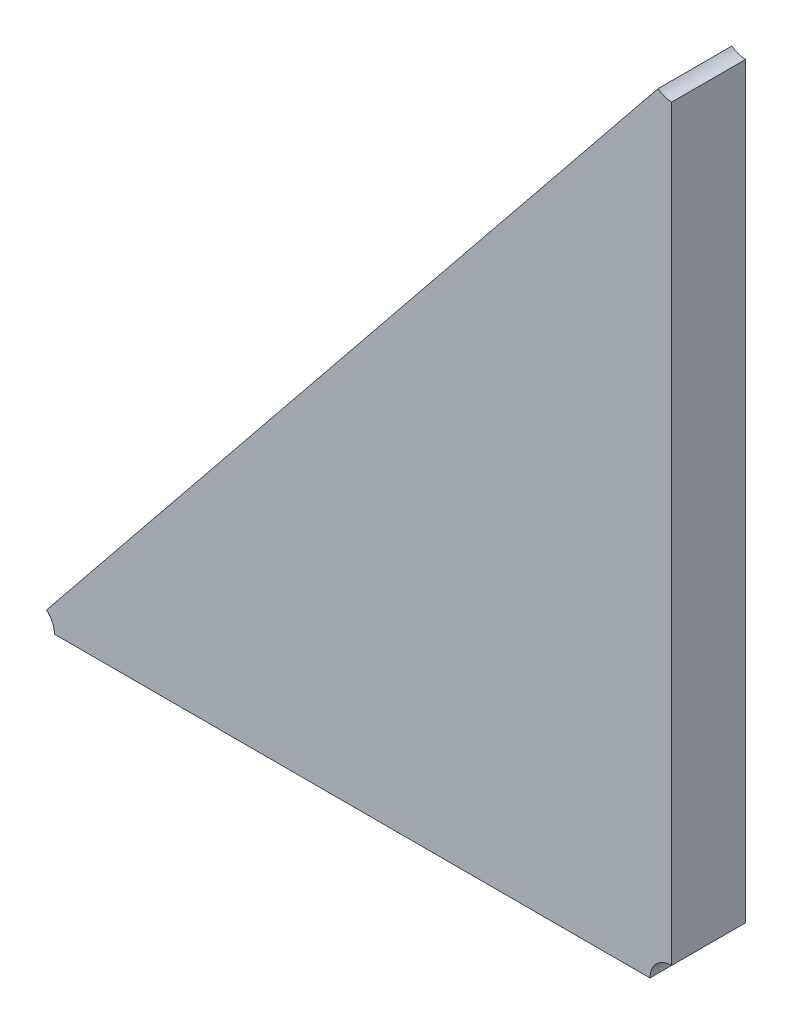
ISO-10303-21;
HEADER;
FILE_DESCRIPTION(('STEP AP214'),'2;1');
FILE_NAME('part.step','',(''),(''),'','','');
FILE_SCHEMA(('AUTOMOTIVE_DESIGN { 1 0 10303 214 1 1 1 1 }'));
ENDSEC;
DATA;
#1=APPLICATION_CONTEXT('core data for automotive mechanical design processes');
#2=APPLICATION_PROTOCOL_DEFINITION('international standard','automotive_design',2000,#1);
#3=PRODUCT_CONTEXT('',#1,'mechanical');
#4=PRODUCT('Part','Part','',(#3));
#5=PRODUCT_RELATED_PRODUCT_CATEGORY('part','',(#4));
#6=PRODUCT_DEFINITION_FORMATION('','',#4);
#7=PRODUCT_DEFINITION_CONTEXT('part definition',#1,'design');
#8=PRODUCT_DEFINITION('design','',#6,#7);
#9=PRODUCT_DEFINITION_SHAPE('','',#8);
#10=(LENGTH_UNIT() NAMED_UNIT(*) SI_UNIT(.MILLI.,.METRE.));
#11=(NAMED_UNIT(*) PLANE_ANGLE_UNIT() SI_UNIT($,.RADIAN.));
#12=(NAMED_UNIT(*) SI_UNIT($,.STERADIAN.) SOLID_ANGLE_UNIT());
#13=UNCERTAINTY_MEASURE_WITH_UNIT(LENGTH_MEASURE(1.E-05),#10,'distance_accuracy_value','');
#14=(GEOMETRIC_REPRESENTATION_CONTEXT(3) GLOBAL_UNCERTAINTY_ASSIGNED_CONTEXT((#13)) GLOBAL_UNIT_ASSIGNED_CONTEXT((#10,
#11,#12)) REPRESENTATION_CONTEXT('',''));
#15=CARTESIAN_POINT('',(0.,0.,0.));
#16=DIRECTION('',(0.,0.,1.));
#17=DIRECTION('',(1.,0.,0.));
#18=AXIS2_PLACEMENT_3D('',#15,#16,#17);
#19=CARTESIAN_POINT('',(-1.38545293845535,-1.33390159204412,0.0042));
#20=DIRECTION('',(0.,0.,1.));
#21=DIRECTION('',(1.,0.,0.));
#22=AXIS2_PLACEMENT_3D('',#19,#20,#21);
#23=PLANE('',#22);
#24=CARTESIAN_POINT('',(-1.40493158368277,-1.34730973343148,0.0042));
#25=DIRECTION('',(0.,0.,-1.));
#26=DIRECTION('',(0.628289208449116,0.777979865129158,0.));
#27=AXIS2_PLACEMENT_3D('',#24,#25,#26);
#28=CIRCLE('',#27,0.000999999999999988);
#29=CARTESIAN_POINT('',(-1.40430329447432,-1.34653175356635,0.0042));
#30=VERTEX_POINT('',#29);
#31=CARTESIAN_POINT('',(-1.40393158368277,-1.34730973343148,0.0042));
#32=VERTEX_POINT('',#31);
#33=EDGE_CURVE('E11',#30,#32,#28,.T.);
#34=ORIENTED_EDGE('',*,*,#33,.T.);
#35=DIRECTION('',(1.,0.,0.));
#36=VECTOR('',#35,1.);
#37=CARTESIAN_POINT('',(-1.40393158368277,-1.34730973343148,0.0042));
#38=LINE('',#37,#36);
#39=CARTESIAN_POINT('',(-1.37652796514819,-1.34730973343148,0.0042));
#40=VERTEX_POINT('',#39);
#41=EDGE_CURVE('E102',#32,#40,#38,.T.);
#42=ORIENTED_EDGE('',*,*,#41,.T.);
#43=CARTESIAN_POINT('',(-1.37552796514819,-1.34730973343148,0.0042));
#44=DIRECTION('',(0.,0.,-1.));
#45=DIRECTION('',(-1.,0.,0.));
#46=AXIS2_PLACEMENT_3D('',#43,#44,#45);
#47=CIRCLE('',#46,0.000999999999999999);
#48=CARTESIAN_POINT('',(-1.37552796514819,-1.34630973343148,0.0042));
#49=VERTEX_POINT('',#48);
#50=EDGE_CURVE('E89',#40,#49,#47,.T.);
#51=ORIENTED_EDGE('',*,*,#50,.T.);
#52=DIRECTION('',(0.,1.,0.));
#53=VECTOR('',#52,1.);
#54=CARTESIAN_POINT('',(-1.37552796514819,-1.34630973343148,0.0042));
#55=LINE('',#54,#53);
#56=CARTESIAN_POINT('',(-1.37552796514819,-1.31190066755203,0.0042));
#57=VERTEX_POINT('',#56);
#58=EDGE_CURVE('E94',#49,#57,#55,.T.);
#59=ORIENTED_EDGE('',*,*,#58,.T.);
#60=CARTESIAN_POINT('',(-1.37552796514819,-1.31090066755203,0.0042));
#61=DIRECTION('',(0.,0.,-1.));
#62=DIRECTION('',(0.,-1.,0.));
#63=AXIS2_PLACEMENT_3D('',#60,#61,#62);
#64=CIRCLE('',#63,0.000999999999999994);
#65=CARTESIAN_POINT('',(-1.37615625435664,-1.31167864741715,0.0042));
#66=VERTEX_POINT('',#65);
#67=EDGE_CURVE('E116',#57,#66,#64,.T.);
#68=ORIENTED_EDGE('',*,*,#67,.T.);
#69=DIRECTION('',(-0.628289208450209,-0.777979865128276,0.));
#70=VECTOR('',#69,1.);
#71=CARTESIAN_POINT('',(-1.37615625435664,-1.31167864741715,0.0042));
#72=LINE('',#71,#70);
#73=EDGE_CURVE('E75',#66,#30,#72,.T.);
#74=ORIENTED_EDGE('',*,*,#73,.T.);
#75=EDGE_LOOP('',(#34,#42,#51,#59,#68,#74));
#76=FACE_BOUND('',#75,.T.);
#77=ADVANCED_FACE('F17',(#76),#23,.T.);
#78=CARTESIAN_POINT('',(-1.40493158368277,-1.34730973343148,0.0012));
#79=DIRECTION('',(0.,0.,1.));
#80=DIRECTION('',(-1.,0.,0.));
#81=AXIS2_PLACEMENT_3D('',#78,#79,#80);
#82=CYLINDRICAL_SURFACE('',#81,0.000999999999999988);
#83=DIRECTION('',(0.,0.,1.));
#84=VECTOR('',#83,1.);
#85=CARTESIAN_POINT('',(-1.40430329447432,-1.34653175356635,0.0008));
#86=LINE('',#85,#84);
#87=CARTESIAN_POINT('',(-1.40430329447432,-1.34653175356635,0.0008));
#88=VERTEX_POINT('',#87);
#89=EDGE_CURVE('E24',#88,#30,#86,.T.);
#90=ORIENTED_EDGE('',*,*,#89,.F.);
#91=CARTESIAN_POINT('',(-1.40493158368277,-1.34730973343148,0.0008));
#92=DIRECTION('',(0.,0.,1.));
#93=DIRECTION('',(1.,0.,0.));
#94=AXIS2_PLACEMENT_3D('',#91,#92,#93);
#95=CIRCLE('',#94,0.000999999999999988);
#96=CARTESIAN_POINT('',(-1.40393158368277,-1.34730973343148,0.0008));
#97=VERTEX_POINT('',#96);
#98=EDGE_CURVE('E72',#97,#88,#95,.T.);
#99=ORIENTED_EDGE('',*,*,#98,.F.);
#100=DIRECTION('',(0.,0.,1.));
#101=VECTOR('',#100,1.);
#102=CARTESIAN_POINT('',(-1.40393158368277,-1.34730973343148,0.0008));
#103=LINE('',#102,#101);
#104=EDGE_CURVE('E90',#97,#32,#103,.T.);
#105=ORIENTED_EDGE('',*,*,#104,.T.);
#106=ORIENTED_EDGE('',*,*,#33,.F.);
#107=EDGE_LOOP('',(#90,#99,#105,#106));
#108=FACE_BOUND('',#107,.T.);
#109=ADVANCED_FACE('F138',(#108),#82,.F.);
#110=CARTESIAN_POINT('',(-1.37552796514819,-1.34730973343148,0.0012));
#111=DIRECTION('',(0.,0.,1.));
#112=DIRECTION('',(-1.,0.,0.));
#113=AXIS2_PLACEMENT_3D('',#110,#111,#112);
#114=CYLINDRICAL_SURFACE('',#113,0.000999999999999999);
#115=DIRECTION('',(0.,0.,-1.));
#116=VECTOR('',#115,1.);
#117=CARTESIAN_POINT('',(-1.37552796514819,-1.34630973343148,0.0042));
#118=LINE('',#117,#116);
#119=CARTESIAN_POINT('',(-1.37552796514819,-1.34630973343148,0.0008));
#120=VERTEX_POINT('',#119);
#121=EDGE_CURVE('E99',#49,#120,#118,.T.);
#122=ORIENTED_EDGE('',*,*,#121,.F.);
#123=ORIENTED_EDGE('',*,*,#50,.F.);
#124=DIRECTION('',(0.,0.,1.));
#125=VECTOR('',#124,1.);
#126=CARTESIAN_POINT('',(-1.37652796514819,-1.34730973343148,0.0008));
#127=LINE('',#126,#125);
#128=CARTESIAN_POINT('',(-1.37652796514819,-1.34730973343148,0.0008));
#129=VERTEX_POINT('',#128);
#130=EDGE_CURVE('E111',#129,#40,#127,.T.);
#131=ORIENTED_EDGE('',*,*,#130,.F.);
#132=CARTESIAN_POINT('',(-1.37552796514819,-1.34730973343148,0.0008));
#133=DIRECTION('',(0.,0.,1.));
#134=DIRECTION('',(0.,1.,0.));
#135=AXIS2_PLACEMENT_3D('',#132,#133,#134);
#136=CIRCLE('',#135,0.000999999999999999);
#137=EDGE_CURVE('E123',#120,#129,#136,.T.);
#138=ORIENTED_EDGE('',*,*,#137,.F.);
#139=EDGE_LOOP('',(#122,#123,#131,#138));
#140=FACE_BOUND('',#139,.T.);
#141=ADVANCED_FACE('F110',(#140),#114,.F.);
#142=CARTESIAN_POINT('',(-1.37552796514819,-1.31090066755203,0.0012));
#143=DIRECTION('',(0.,0.,1.));
#144=DIRECTION('',(-1.,0.,0.));
#145=AXIS2_PLACEMENT_3D('',#142,#143,#144);
#146=CYLINDRICAL_SURFACE('',#145,0.000999999999999994);
#147=DIRECTION('',(0.,0.,-1.));
#148=VECTOR('',#147,1.);
#149=CARTESIAN_POINT('',(-1.37615625435664,-1.31167864741715,0.0042));
#150=LINE('',#149,#148);
#151=CARTESIAN_POINT('',(-1.37615625435664,-1.31167864741715,0.0008));
#152=VERTEX_POINT('',#151);
#153=EDGE_CURVE('E80',#66,#152,#150,.T.);
#154=ORIENTED_EDGE('',*,*,#153,.F.);
#155=ORIENTED_EDGE('',*,*,#67,.F.);
#156=DIRECTION('',(0.,0.,1.));
#157=VECTOR('',#156,1.);
#158=CARTESIAN_POINT('',(-1.37552796514819,-1.31190066755203,0.0008));
#159=LINE('',#158,#157);
#160=CARTESIAN_POINT('',(-1.37552796514819,-1.31190066755203,0.0008));
#161=VERTEX_POINT('',#160);
#162=EDGE_CURVE('E83',#161,#57,#159,.T.);
#163=ORIENTED_EDGE('',*,*,#162,.F.);
#164=CARTESIAN_POINT('',(-1.37552796514819,-1.31090066755203,0.0008));
#165=DIRECTION('',(0.,0.,1.));
#166=DIRECTION('',(-0.628289208454161,-0.777979865125084,0.));
#167=AXIS2_PLACEMENT_3D('',#164,#165,#166);
#168=CIRCLE('',#167,0.000999999999999994);
#169=EDGE_CURVE('E70',#152,#161,#168,.T.);
#170=ORIENTED_EDGE('',*,*,#169,.F.);
#171=EDGE_LOOP('',(#154,#155,#163,#170));
#172=FACE_BOUND('',#171,.T.);
#173=ADVANCED_FACE('F78',(#172),#146,.F.);
#174=CARTESIAN_POINT('',(-1.37552796514819,-1.34730973343148,0.0008));
#175=DIRECTION('',(0.,1.,0.));
#176=DIRECTION('',(-1.,0.,0.));
#177=AXIS2_PLACEMENT_3D('',#174,#175,#176);
#178=PLANE('',#177);
#179=ORIENTED_EDGE('',*,*,#104,.F.);
#180=DIRECTION('',(-1.,0.,0.));
#181=VECTOR('',#180,1.);
#182=CARTESIAN_POINT('',(-1.37652796514819,-1.34730973343148,0.0008));
#183=LINE('',#182,#181);
#184=EDGE_CURVE('E114',#129,#97,#183,.T.);
#185=ORIENTED_EDGE('',*,*,#184,.F.);
#186=ORIENTED_EDGE('',*,*,#130,.T.);
#187=ORIENTED_EDGE('',*,*,#41,.F.);
#188=EDGE_LOOP('',(#179,#185,#186,#187));
#189=FACE_BOUND('',#188,.T.);
#190=ADVANCED_FACE('F113',(#189),#178,.F.);
#191=CARTESIAN_POINT('',(-1.38547647740622,-1.33385849750101,0.0008));
#192=DIRECTION('',(0.,0.,-1.));
#193=DIRECTION('',(-1.,0.,0.));
#194=AXIS2_PLACEMENT_3D('',#191,#192,#193);
#195=PLANE('',#194);
#196=ORIENTED_EDGE('',*,*,#98,.T.);
#197=DIRECTION('',(0.628289208450214,0.777979865128271,0.));
#198=VECTOR('',#197,1.);
#199=CARTESIAN_POINT('',(-1.40430329447432,-1.34653175356635,0.0008));
#200=LINE('',#199,#198);
#201=EDGE_CURVE('E66',#88,#152,#200,.T.);
#202=ORIENTED_EDGE('',*,*,#201,.T.);
#203=ORIENTED_EDGE('',*,*,#169,.T.);
#204=DIRECTION('',(0.,-1.,0.));
#205=VECTOR('',#204,1.);
#206=CARTESIAN_POINT('',(-1.37552796514819,-1.31190066755203,0.0008));
#207=LINE('',#206,#205);
#208=EDGE_CURVE('E85',#161,#120,#207,.T.);
#209=ORIENTED_EDGE('',*,*,#208,.T.);
#210=ORIENTED_EDGE('',*,*,#137,.T.);
#211=ORIENTED_EDGE('',*,*,#184,.T.);
#212=EDGE_LOOP('',(#196,#202,#203,#209,#210,#211));
#213=FACE_BOUND('',#212,.T.);
#214=ADVANCED_FACE('F68',(#213),#195,.T.);
#215=CARTESIAN_POINT('',(-1.37552796514819,-1.31090066755203,0.0008));
#216=DIRECTION('',(-1.,0.,0.));
#217=DIRECTION('',(0.,-1.,0.));
#218=AXIS2_PLACEMENT_3D('',#215,#216,#217);
#219=PLANE('',#218);
#220=ORIENTED_EDGE('',*,*,#121,.T.);
#221=ORIENTED_EDGE('',*,*,#208,.F.);
#222=ORIENTED_EDGE('',*,*,#162,.T.);
#223=ORIENTED_EDGE('',*,*,#58,.F.);
#224=EDGE_LOOP('',(#220,#221,#222,#223));
#225=FACE_BOUND('',#224,.T.);
#226=ADVANCED_FACE('F122',(#225),#219,.F.);
#227=CARTESIAN_POINT('',(-1.40493158368277,-1.34730973343148,0.0008));
#228=DIRECTION('',(0.777979865128275,-0.628289208450209,0.));
#229=DIRECTION('',(0.628289208450209,0.777979865128275,0.));
#230=AXIS2_PLACEMENT_3D('',#227,#228,#229);
#231=PLANE('',#230);
#232=ORIENTED_EDGE('',*,*,#89,.T.);
#233=ORIENTED_EDGE('',*,*,#73,.F.);
#234=ORIENTED_EDGE('',*,*,#153,.T.);
#235=ORIENTED_EDGE('',*,*,#201,.F.);
#236=EDGE_LOOP('',(#232,#233,#234,#235));
#237=FACE_BOUND('',#236,.T.);
#238=ADVANCED_FACE('F88',(#237),#231,.F.);
#239=CLOSED_SHELL('',(#77,#109,#141,#173,#190,#214,#226,#238));
#240=MANIFOLD_SOLID_BREP('B1',#239);
#241=ADVANCED_BREP_SHAPE_REPRESENTATION('',(#18,#240),#14);
#242=SHAPE_DEFINITION_REPRESENTATION(#9,#241);
ENDSEC;
END-ISO-10303-21;
